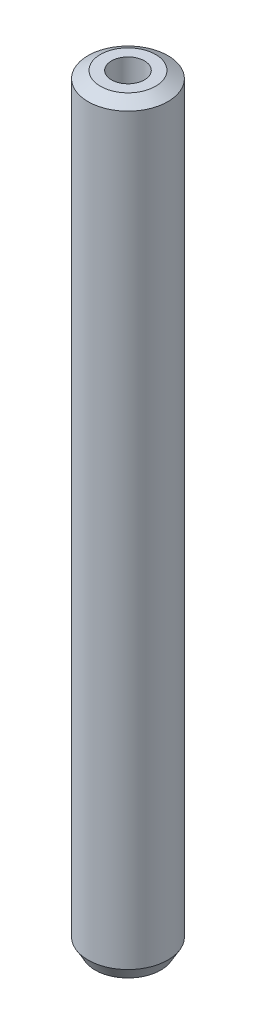
ISO-10303-21;
HEADER;
FILE_DESCRIPTION(('STEP AP214'),'2;1');
FILE_NAME('part.step','',(''),(''),'','','');
FILE_SCHEMA(('AUTOMOTIVE_DESIGN { 1 0 10303 214 1 1 1 1 }'));
ENDSEC;
DATA;
#1=APPLICATION_CONTEXT('core data for automotive mechanical design processes');
#2=APPLICATION_PROTOCOL_DEFINITION('international standard','automotive_design',2000,#1);
#3=PRODUCT_CONTEXT('',#1,'mechanical');
#4=PRODUCT('Part','Part','',(#3));
#5=PRODUCT_RELATED_PRODUCT_CATEGORY('part','',(#4));
#6=PRODUCT_DEFINITION_FORMATION('','',#4);
#7=PRODUCT_DEFINITION_CONTEXT('part definition',#1,'design');
#8=PRODUCT_DEFINITION('design','',#6,#7);
#9=PRODUCT_DEFINITION_SHAPE('','',#8);
#10=(LENGTH_UNIT() NAMED_UNIT(*) SI_UNIT(.MILLI.,.METRE.));
#11=(NAMED_UNIT(*) PLANE_ANGLE_UNIT() SI_UNIT($,.RADIAN.));
#12=(NAMED_UNIT(*) SI_UNIT($,.STERADIAN.) SOLID_ANGLE_UNIT());
#13=UNCERTAINTY_MEASURE_WITH_UNIT(LENGTH_MEASURE(1.E-05),#10,'distance_accuracy_value','');
#14=(GEOMETRIC_REPRESENTATION_CONTEXT(3) GLOBAL_UNCERTAINTY_ASSIGNED_CONTEXT((#13)) GLOBAL_UNIT_ASSIGNED_CONTEXT((#10,
#11,#12)) REPRESENTATION_CONTEXT('',''));
#15=CARTESIAN_POINT('',(0.,0.,0.));
#16=DIRECTION('',(0.,0.,1.));
#17=DIRECTION('',(1.,0.,0.));
#18=AXIS2_PLACEMENT_3D('',#15,#16,#17);
#19=CARTESIAN_POINT('',(0.,191.075567301023,0.));
#20=DIRECTION('',(0.,-1.,0.));
#21=DIRECTION('',(0.,0.,-1.));
#22=AXIS2_PLACEMENT_3D('',#19,#20,#21);
#23=CYLINDRICAL_SURFACE('',#22,10.);
#24=CARTESIAN_POINT('',(0.,189.289588505621,0.));
#25=DIRECTION('',(0.,1.,0.));
#26=DIRECTION('',(0.,0.,1.));
#27=AXIS2_PLACEMENT_3D('',#24,#25,#26);
#28=CIRCLE('',#27,10.);
#29=CARTESIAN_POINT('',(0.,189.289588505621,10.));
#30=VERTEX_POINT('',#29);
#31=EDGE_CURVE('E50',#30,#30,#28,.F.);
#32=ORIENTED_EDGE('',*,*,#31,.T.);
#33=EDGE_LOOP('',(#32));
#34=FACE_BOUND('',#33,.T.);
#35=CARTESIAN_POINT('',(0.,3.0934060148774,0.));
#36=DIRECTION('',(0.,1.,0.));
#37=DIRECTION('',(0.,0.,1.));
#38=AXIS2_PLACEMENT_3D('',#35,#36,#37);
#39=CIRCLE('',#38,10.);
#40=CARTESIAN_POINT('',(0.,3.0934060148774,10.));
#41=VERTEX_POINT('',#40);
#42=EDGE_CURVE('E51',#41,#41,#39,.T.);
#43=ORIENTED_EDGE('',*,*,#42,.T.);
#44=EDGE_LOOP('',(#43));
#45=FACE_BOUND('',#44,.T.);
#46=ADVANCED_FACE('F39',(#34,#45),#23,.T.);
#47=CARTESIAN_POINT('',(0.,191.075567301023,0.));
#48=DIRECTION('',(0.,1.,0.));
#49=DIRECTION('',(0.,0.,1.));
#50=AXIS2_PLACEMENT_3D('',#47,#48,#49);
#51=PLANE('',#50);
#52=CARTESIAN_POINT('',(0.,191.075567301023,0.));
#53=DIRECTION('',(0.,1.,0.));
#54=DIRECTION('',(0.,0.,1.));
#55=AXIS2_PLACEMENT_3D('',#52,#53,#54);
#56=CIRCLE('',#55,6.90659398512256);
#57=CARTESIAN_POINT('',(0.,191.075567301023,6.90659398512256));
#58=VERTEX_POINT('',#57);
#59=EDGE_CURVE('E54',#58,#58,#56,.T.);
#60=ORIENTED_EDGE('',*,*,#59,.T.);
#61=EDGE_LOOP('',(#60));
#62=FACE_BOUND('',#61,.T.);
#63=CARTESIAN_POINT('',(0.,191.075567301023,0.));
#64=DIRECTION('',(0.,1.,0.));
#65=DIRECTION('',(0.,0.,1.));
#66=AXIS2_PLACEMENT_3D('',#63,#64,#65);
#67=CIRCLE('',#66,4.13339957898974);
#68=CARTESIAN_POINT('',(0.,191.075567301023,4.13339957898974));
#69=VERTEX_POINT('',#68);
#70=EDGE_CURVE('E58',#69,#69,#67,.T.);
#71=ORIENTED_EDGE('',*,*,#70,.F.);
#72=EDGE_LOOP('',(#71));
#73=FACE_BOUND('',#72,.T.);
#74=ADVANCED_FACE('F69',(#62,#73),#51,.T.);
#75=CARTESIAN_POINT('',(0.,0.,0.));
#76=DIRECTION('',(0.,1.,0.));
#77=DIRECTION('',(0.,0.,1.));
#78=AXIS2_PLACEMENT_3D('',#75,#76,#77);
#79=PLANE('',#78);
#80=CARTESIAN_POINT('',(0.,0.,0.));
#81=DIRECTION('',(0.,1.,0.));
#82=DIRECTION('',(0.,0.,1.));
#83=AXIS2_PLACEMENT_3D('',#80,#81,#82);
#84=CIRCLE('',#83,8.2140212045977);
#85=CARTESIAN_POINT('',(0.,0.,8.2140212045977));
#86=VERTEX_POINT('',#85);
#87=EDGE_CURVE('E10',#86,#86,#84,.F.);
#88=ORIENTED_EDGE('',*,*,#87,.T.);
#89=EDGE_LOOP('',(#88));
#90=FACE_BOUND('',#89,.T.);
#91=CARTESIAN_POINT('',(0.,0.,0.));
#92=DIRECTION('',(0.,1.,0.));
#93=DIRECTION('',(0.,0.,1.));
#94=AXIS2_PLACEMENT_3D('',#91,#92,#93);
#95=CIRCLE('',#94,4.13339957898974);
#96=CARTESIAN_POINT('',(0.,0.,4.13339957898974));
#97=VERTEX_POINT('',#96);
#98=EDGE_CURVE('E63',#97,#97,#95,.T.);
#99=ORIENTED_EDGE('',*,*,#98,.T.);
#100=EDGE_LOOP('',(#99));
#101=FACE_BOUND('',#100,.T.);
#102=ADVANCED_FACE('F75',(#90,#101),#79,.F.);
#103=CARTESIAN_POINT('',(0.,191.075567301023,0.));
#104=DIRECTION('',(0.,-1.,0.));
#105=DIRECTION('',(0.,0.,-1.));
#106=AXIS2_PLACEMENT_3D('',#103,#104,#105);
#107=CYLINDRICAL_SURFACE('',#106,4.13339957898974);
#108=ORIENTED_EDGE('',*,*,#70,.T.);
#109=EDGE_LOOP('',(#108));
#110=FACE_BOUND('',#109,.T.);
#111=ORIENTED_EDGE('',*,*,#98,.F.);
#112=EDGE_LOOP('',(#111));
#113=FACE_BOUND('',#112,.T.);
#114=ADVANCED_FACE('F70',(#110,#113),#107,.F.);
#115=CARTESIAN_POINT('',(0.,191.075567301023,0.));
#116=DIRECTION('',(0.,-1.,0.));
#117=DIRECTION('',(0.,0.,-1.));
#118=AXIS2_PLACEMENT_3D('',#115,#116,#117);
#119=CONICAL_SURFACE('',#118,6.90659398512256,1.04719755119659);
#120=ORIENTED_EDGE('',*,*,#31,.F.);
#121=EDGE_LOOP('',(#120));
#122=FACE_BOUND('',#121,.T.);
#123=ORIENTED_EDGE('',*,*,#59,.F.);
#124=EDGE_LOOP('',(#123));
#125=FACE_BOUND('',#124,.T.);
#126=ADVANCED_FACE('F81',(#122,#125),#119,.T.);
#127=CARTESIAN_POINT('',(0.,3.0934060148774,0.));
#128=DIRECTION('',(0.,1.,0.));
#129=DIRECTION('',(0.,0.,1.));
#130=AXIS2_PLACEMENT_3D('',#127,#128,#129);
#131=CONICAL_SURFACE('',#130,10.,0.523598775598305);
#132=ORIENTED_EDGE('',*,*,#87,.F.);
#133=EDGE_LOOP('',(#132));
#134=FACE_BOUND('',#133,.T.);
#135=ORIENTED_EDGE('',*,*,#42,.F.);
#136=EDGE_LOOP('',(#135));
#137=FACE_BOUND('',#136,.T.);
#138=ADVANCED_FACE('F45',(#134,#137),#131,.T.);
#139=CLOSED_SHELL('',(#46,#74,#102,#114,#126,#138));
#140=MANIFOLD_SOLID_BREP('B2',#139);
#141=ADVANCED_BREP_SHAPE_REPRESENTATION('',(#18,#140),#14);
#142=SHAPE_DEFINITION_REPRESENTATION(#9,#141);
ENDSEC;
END-ISO-10303-21;
